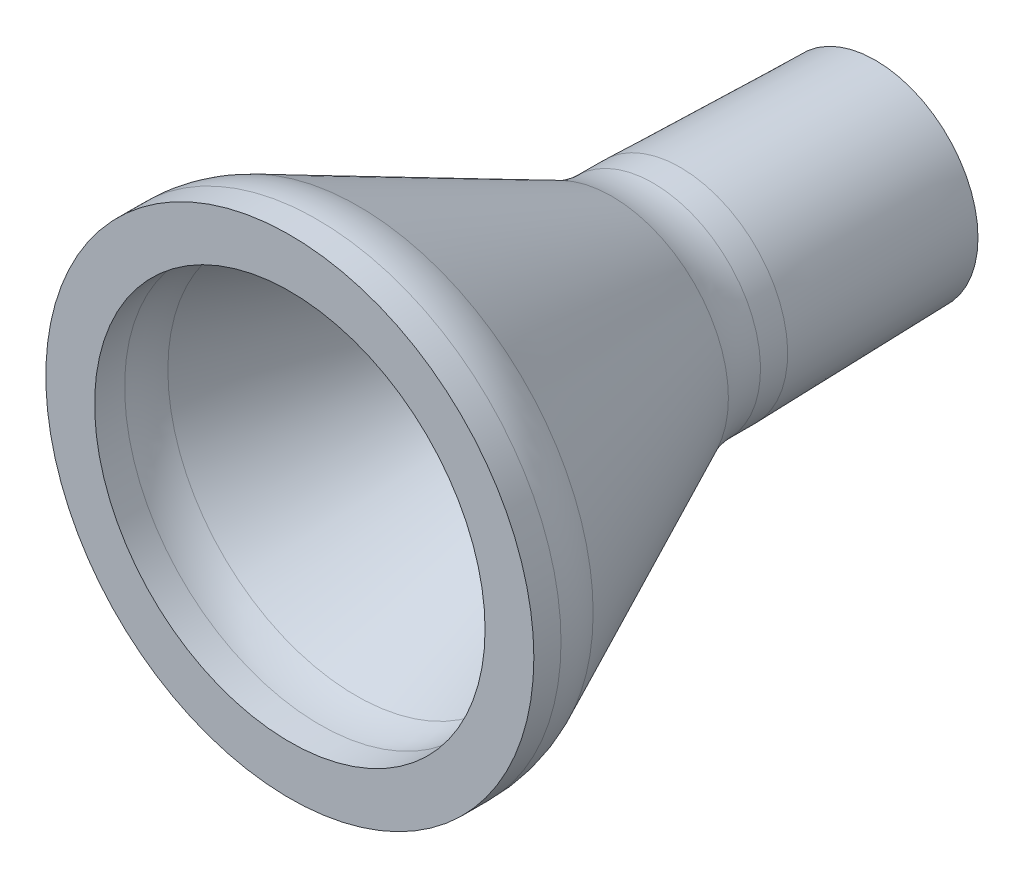
ISO-10303-21;
HEADER;
FILE_DESCRIPTION(('STEP AP214'),'2;1');
FILE_NAME('part.step','',(''),(''),'','','');
FILE_SCHEMA(('AUTOMOTIVE_DESIGN { 1 0 10303 214 1 1 1 1 }'));
ENDSEC;
DATA;
#1=APPLICATION_CONTEXT('core data for automotive mechanical design processes');
#2=APPLICATION_PROTOCOL_DEFINITION('international standard','automotive_design',2000,#1);
#3=PRODUCT_CONTEXT('',#1,'mechanical');
#4=PRODUCT('Part','Part','',(#3));
#5=PRODUCT_RELATED_PRODUCT_CATEGORY('part','',(#4));
#6=PRODUCT_DEFINITION_FORMATION('','',#4);
#7=PRODUCT_DEFINITION_CONTEXT('part definition',#1,'design');
#8=PRODUCT_DEFINITION('design','',#6,#7);
#9=PRODUCT_DEFINITION_SHAPE('','',#8);
#10=(LENGTH_UNIT() NAMED_UNIT(*) SI_UNIT(.MILLI.,.METRE.));
#11=(NAMED_UNIT(*) PLANE_ANGLE_UNIT() SI_UNIT($,.RADIAN.));
#12=(NAMED_UNIT(*) SI_UNIT($,.STERADIAN.) SOLID_ANGLE_UNIT());
#13=UNCERTAINTY_MEASURE_WITH_UNIT(LENGTH_MEASURE(1.E-05),#10,'distance_accuracy_value','');
#14=(GEOMETRIC_REPRESENTATION_CONTEXT(3) GLOBAL_UNCERTAINTY_ASSIGNED_CONTEXT((#13)) GLOBAL_UNIT_ASSIGNED_CONTEXT((#10,
#11,#12)) REPRESENTATION_CONTEXT('',''));
#15=CARTESIAN_POINT('',(0.,0.,0.));
#16=DIRECTION('',(0.,0.,1.));
#17=DIRECTION('',(1.,0.,0.));
#18=AXIS2_PLACEMENT_3D('',#15,#16,#17);
#19=CARTESIAN_POINT('',(0.,0.,5.));
#20=DIRECTION('',(0.,0.,1.));
#21=DIRECTION('',(1.,0.,0.));
#22=AXIS2_PLACEMENT_3D('',#19,#20,#21);
#23=PLANE('',#22);
#24=CARTESIAN_POINT('',(0.,0.,5.));
#25=DIRECTION('',(0.,0.,1.));
#26=DIRECTION('',(1.,0.,0.));
#27=AXIS2_PLACEMENT_3D('',#24,#25,#26);
#28=CIRCLE('',#27,25.);
#29=CARTESIAN_POINT('',(25.,0.,5.));
#30=VERTEX_POINT('',#29);
#31=EDGE_CURVE('E152',#30,#30,#28,.T.);
#32=ORIENTED_EDGE('',*,*,#31,.T.);
#33=EDGE_LOOP('',(#32));
#34=FACE_BOUND('',#33,.T.);
#35=CARTESIAN_POINT('',(0.,0.,5.));
#36=DIRECTION('',(0.,0.,1.));
#37=DIRECTION('',(1.,0.,0.));
#38=AXIS2_PLACEMENT_3D('',#35,#36,#37);
#39=CIRCLE('',#38,20.);
#40=CARTESIAN_POINT('',(20.,0.,5.));
#41=VERTEX_POINT('',#40);
#42=EDGE_CURVE('E378',#41,#41,#39,.T.);
#43=ORIENTED_EDGE('',*,*,#42,.F.);
#44=EDGE_LOOP('',(#43));
#45=FACE_BOUND('',#44,.T.);
#46=ADVANCED_FACE('F126',(#34,#45),#23,.T.);
#47=CARTESIAN_POINT('',(0.,0.,5.));
#48=DIRECTION('',(0.,0.,-1.));
#49=DIRECTION('',(-1.,0.,0.));
#50=AXIS2_PLACEMENT_3D('',#47,#48,#49);
#51=CYLINDRICAL_SURFACE('',#50,25.);
#52=CARTESIAN_POINT('',(0.,0.,2.21849336749549));
#53=DIRECTION('',(0.,0.,1.));
#54=DIRECTION('',(1.,0.,0.));
#55=AXIS2_PLACEMENT_3D('',#52,#53,#54);
#56=CIRCLE('',#55,25.);
#57=CARTESIAN_POINT('',(25.,0.,2.21849336749549));
#58=VERTEX_POINT('',#57);
#59=EDGE_CURVE('E11',#58,#58,#56,.T.);
#60=ORIENTED_EDGE('',*,*,#59,.T.);
#61=EDGE_LOOP('',(#60));
#62=FACE_BOUND('',#61,.T.);
#63=ORIENTED_EDGE('',*,*,#31,.F.);
#64=EDGE_LOOP('',(#63));
#65=FACE_BOUND('',#64,.T.);
#66=ADVANCED_FACE('F213',(#62,#65),#51,.T.);
#67=CARTESIAN_POINT('',(0.,0.,5.));
#68=DIRECTION('',(0.,0.,-1.));
#69=DIRECTION('',(-1.,0.,0.));
#70=AXIS2_PLACEMENT_3D('',#67,#68,#69);
#71=CYLINDRICAL_SURFACE('',#70,20.);
#72=CARTESIAN_POINT('',(0.,0.,1.92582403567252));
#73=DIRECTION('',(0.,0.,1.));
#74=DIRECTION('',(1.,0.,0.));
#75=AXIS2_PLACEMENT_3D('',#72,#73,#74);
#76=CIRCLE('',#75,20.);
#77=CARTESIAN_POINT('',(20.,0.,1.92582403567252));
#78=VERTEX_POINT('',#77);
#79=EDGE_CURVE('E146',#78,#78,#76,.F.);
#80=ORIENTED_EDGE('',*,*,#79,.T.);
#81=EDGE_LOOP('',(#80));
#82=FACE_BOUND('',#81,.T.);
#83=ORIENTED_EDGE('',*,*,#42,.T.);
#84=EDGE_LOOP('',(#83));
#85=FACE_BOUND('',#84,.T.);
#86=ADVANCED_FACE('F210',(#82,#85),#71,.F.);
#87=CARTESIAN_POINT('',(0.,0.,-30.));
#88=DIRECTION('',(0.,0.,1.));
#89=DIRECTION('',(1.,0.,0.));
#90=AXIS2_PLACEMENT_3D('',#87,#88,#89);
#91=CONICAL_SURFACE('',#90,11.,0.436627159813542);
#92=CARTESIAN_POINT('',(0.,0.,-27.9896387141843));
#93=DIRECTION('',(0.,0.,-1.));
#94=DIRECTION('',(-1.,0.,0.));
#95=AXIS2_PLACEMENT_3D('',#92,#93,#94);
#96=CIRCLE('',#95,11.9381686000473);
#97=CARTESIAN_POINT('',(-11.9381686000473,0.,-27.9896387141843));
#98=VERTEX_POINT('',#97);
#99=EDGE_CURVE('E133',#98,#98,#96,.F.);
#100=ORIENTED_EDGE('',*,*,#99,.T.);
#101=EDGE_LOOP('',(#100));
#102=FACE_BOUND('',#101,.T.);
#103=CARTESIAN_POINT('',(0.,0.,-2.01036128581575));
#104=DIRECTION('',(0.,0.,1.));
#105=DIRECTION('',(1.,0.,0.));
#106=AXIS2_PLACEMENT_3D('',#103,#104,#105);
#107=CIRCLE('',#106,24.0618313999527);
#108=CARTESIAN_POINT('',(24.0618313999527,0.,-2.01036128581575));
#109=VERTEX_POINT('',#108);
#110=EDGE_CURVE('E137',#109,#109,#107,.F.);
#111=ORIENTED_EDGE('',*,*,#110,.T.);
#112=EDGE_LOOP('',(#111));
#113=FACE_BOUND('',#112,.T.);
#114=ADVANCED_FACE('F206',(#102,#113),#91,.T.);
#115=CARTESIAN_POINT('',(0.,0.,-30.));
#116=DIRECTION('',(0.,0.,1.));
#117=DIRECTION('',(1.,0.,0.));
#118=AXIS2_PLACEMENT_3D('',#115,#116,#117);
#119=CONICAL_SURFACE('',#118,8.,0.380506377112365);
#120=CARTESIAN_POINT('',(0.,0.,-1.78808272786853));
#121=DIRECTION('',(0.,0.,-1.));
#122=DIRECTION('',(-1.,0.,0.));
#123=AXIS2_PLACEMENT_3D('',#120,#121,#122);
#124=CIRCLE('',#123,19.2847669088526);
#125=CARTESIAN_POINT('',(-19.2847669088526,0.,-1.78808272786853));
#126=VERTEX_POINT('',#125);
#127=EDGE_CURVE('E149',#126,#126,#124,.F.);
#128=ORIENTED_EDGE('',*,*,#127,.T.);
#129=EDGE_LOOP('',(#128));
#130=FACE_BOUND('',#129,.T.);
#131=CARTESIAN_POINT('',(0.,0.,-30.));
#132=DIRECTION('',(0.,0.,-1.));
#133=DIRECTION('',(-1.,0.,0.));
#134=AXIS2_PLACEMENT_3D('',#131,#132,#133);
#135=CIRCLE('',#134,8.);
#136=CARTESIAN_POINT('',(-8.,0.,-30.));
#137=VERTEX_POINT('',#136);
#138=EDGE_CURVE('E192',#137,#137,#135,.F.);
#139=ORIENTED_EDGE('',*,*,#138,.F.);
#140=EDGE_LOOP('',(#139));
#141=FACE_BOUND('',#140,.T.);
#142=ADVANCED_FACE('F197',(#130,#141),#119,.F.);
#143=CARTESIAN_POINT('',(0.,0.,-35.));
#144=DIRECTION('',(0.,0.,1.));
#145=DIRECTION('',(1.,0.,0.));
#146=AXIS2_PLACEMENT_3D('',#143,#144,#145);
#147=CYLINDRICAL_SURFACE('',#146,11.);
#148=CARTESIAN_POINT('',(0.,0.,-32.2184933674955));
#149=DIRECTION('',(0.,0.,-1.));
#150=DIRECTION('',(-1.,0.,0.));
#151=AXIS2_PLACEMENT_3D('',#148,#149,#150);
#152=CIRCLE('',#151,11.);
#153=CARTESIAN_POINT('',(-11.,0.,-32.2184933674955));
#154=VERTEX_POINT('',#153);
#155=EDGE_CURVE('E141',#154,#154,#152,.T.);
#156=ORIENTED_EDGE('',*,*,#155,.T.);
#157=EDGE_LOOP('',(#156));
#158=FACE_BOUND('',#157,.T.);
#159=CARTESIAN_POINT('',(0.,0.,-35.));
#160=DIRECTION('',(0.,0.,-1.));
#161=DIRECTION('',(0.,1.,0.));
#162=AXIS2_PLACEMENT_3D('',#159,#160,#161);
#163=CIRCLE('',#162,11.);
#164=CARTESIAN_POINT('',(0.,11.,-35.));
#165=VERTEX_POINT('',#164);
#166=EDGE_CURVE('E238',#165,#165,#163,.T.);
#167=ORIENTED_EDGE('',*,*,#166,.F.);
#168=EDGE_LOOP('',(#167));
#169=FACE_BOUND('',#168,.T.);
#170=ADVANCED_FACE('F170',(#158,#169),#147,.T.);
#171=CARTESIAN_POINT('',(0.,0.,-35.));
#172=DIRECTION('',(0.,0.,1.));
#173=DIRECTION('',(1.,0.,0.));
#174=AXIS2_PLACEMENT_3D('',#171,#172,#173);
#175=CYLINDRICAL_SURFACE('',#174,8.);
#176=ORIENTED_EDGE('',*,*,#138,.T.);
#177=EDGE_LOOP('',(#176));
#178=FACE_BOUND('',#177,.T.);
#179=CARTESIAN_POINT('',(0.,0.,-55.));
#180=DIRECTION('',(0.,0.,-1.));
#181=DIRECTION('',(-1.,0.,0.));
#182=AXIS2_PLACEMENT_3D('',#179,#180,#181);
#183=CIRCLE('',#182,8.);
#184=CARTESIAN_POINT('',(-8.,0.,-55.));
#185=VERTEX_POINT('',#184);
#186=EDGE_CURVE('E256',#185,#185,#183,.F.);
#187=ORIENTED_EDGE('',*,*,#186,.F.);
#188=EDGE_LOOP('',(#187));
#189=FACE_BOUND('',#188,.T.);
#190=ADVANCED_FACE('F159',(#178,#189),#175,.F.);
#191=CARTESIAN_POINT('',(0.,0.,-55.));
#192=DIRECTION('',(0.,0.,1.));
#193=DIRECTION('',(1.,0.,0.));
#194=AXIS2_PLACEMENT_3D('',#191,#192,#193);
#195=CONICAL_SURFACE('',#194,10.5,0.0249947936189201);
#196=CARTESIAN_POINT('',(0.,0.,-55.));
#197=DIRECTION('',(0.,0.,-1.));
#198=DIRECTION('',(-1.,0.,0.));
#199=AXIS2_PLACEMENT_3D('',#196,#197,#198);
#200=CIRCLE('',#199,10.5);
#201=CARTESIAN_POINT('',(-10.5,0.,-55.));
#202=VERTEX_POINT('',#201);
#203=EDGE_CURVE('E242',#202,#202,#200,.F.);
#204=ORIENTED_EDGE('',*,*,#203,.T.);
#205=EDGE_LOOP('',(#204));
#206=FACE_BOUND('',#205,.T.);
#207=ORIENTED_EDGE('',*,*,#166,.T.);
#208=EDGE_LOOP('',(#207));
#209=FACE_BOUND('',#208,.T.);
#210=ADVANCED_FACE('F169',(#206,#209),#195,.T.);
#211=CARTESIAN_POINT('',(0.,0.,-55.));
#212=DIRECTION('',(0.,0.,1.));
#213=DIRECTION('',(1.,0.,0.));
#214=AXIS2_PLACEMENT_3D('',#211,#212,#213);
#215=PLANE('',#214);
#216=ORIENTED_EDGE('',*,*,#186,.T.);
#217=EDGE_LOOP('',(#216));
#218=FACE_BOUND('',#217,.T.);
#219=ORIENTED_EDGE('',*,*,#203,.F.);
#220=EDGE_LOOP('',(#219));
#221=FACE_BOUND('',#220,.T.);
#222=ADVANCED_FACE('F223',(#218,#221),#215,.F.);
#223=CARTESIAN_POINT('',(0.,0.,1.92582403567252));
#224=DIRECTION('',(0.,0.,1.));
#225=DIRECTION('',(1.,0.,0.));
#226=AXIS2_PLACEMENT_3D('',#223,#224,#225);
#227=DEGENERATE_TOROIDAL_SURFACE('',#226,10.,10.,.T.);
#228=ORIENTED_EDGE('',*,*,#79,.F.);
#229=EDGE_LOOP('',(#228));
#230=FACE_BOUND('',#229,.T.);
#231=ORIENTED_EDGE('',*,*,#127,.F.);
#232=EDGE_LOOP('',(#231));
#233=FACE_BOUND('',#232,.T.);
#234=ADVANCED_FACE('F220',(#230,#233),#227,.F.);
#235=CARTESIAN_POINT('',(0.,0.,-32.2184933674955));
#236=DIRECTION('',(0.,0.,-1.));
#237=DIRECTION('',(-1.,0.,0.));
#238=AXIS2_PLACEMENT_3D('',#235,#236,#237);
#239=TOROIDAL_SURFACE('',#238,21.,10.);
#240=ORIENTED_EDGE('',*,*,#99,.F.);
#241=EDGE_LOOP('',(#240));
#242=FACE_BOUND('',#241,.T.);
#243=ORIENTED_EDGE('',*,*,#155,.F.);
#244=EDGE_LOOP('',(#243));
#245=FACE_BOUND('',#244,.T.);
#246=ADVANCED_FACE('F222',(#242,#245),#239,.F.);
#247=CARTESIAN_POINT('',(0.,0.,2.21849336749549));
#248=DIRECTION('',(0.,0.,1.));
#249=DIRECTION('',(1.,0.,0.));
#250=AXIS2_PLACEMENT_3D('',#247,#248,#249);
#251=TOROIDAL_SURFACE('',#250,15.,10.);
#252=ORIENTED_EDGE('',*,*,#59,.F.);
#253=EDGE_LOOP('',(#252));
#254=FACE_BOUND('',#253,.T.);
#255=ORIENTED_EDGE('',*,*,#110,.F.);
#256=EDGE_LOOP('',(#255));
#257=FACE_BOUND('',#256,.T.);
#258=ADVANCED_FACE('F128',(#254,#257),#251,.T.);
#259=CLOSED_SHELL('',(#46,#66,#86,#114,#142,#170,#190,#210,#222,#234,#246,#258));
#260=MANIFOLD_SOLID_BREP('B2',#259);
#261=ADVANCED_BREP_SHAPE_REPRESENTATION('',(#18,#260),#14);
#262=SHAPE_DEFINITION_REPRESENTATION(#9,#261);
ENDSEC;
END-ISO-10303-21;
